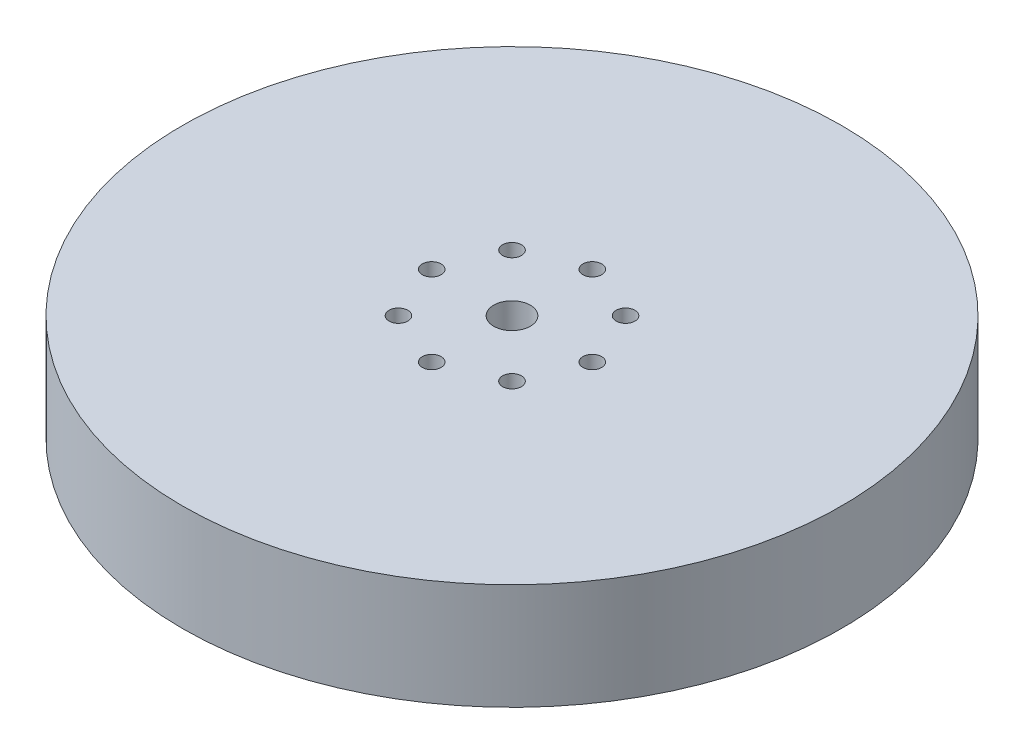
ISO-10303-21;
HEADER;
FILE_DESCRIPTION(('STEP AP214'),'2;1');
FILE_NAME('part.step','',(''),(''),'','','');
FILE_SCHEMA(('AUTOMOTIVE_DESIGN { 1 0 10303 214 1 1 1 1 }'));
ENDSEC;
DATA;
#1=APPLICATION_CONTEXT('core data for automotive mechanical design processes');
#2=APPLICATION_PROTOCOL_DEFINITION('international standard','automotive_design',2000,#1);
#3=PRODUCT_CONTEXT('',#1,'mechanical');
#4=PRODUCT('Part','Part','',(#3));
#5=PRODUCT_RELATED_PRODUCT_CATEGORY('part','',(#4));
#6=PRODUCT_DEFINITION_FORMATION('','',#4);
#7=PRODUCT_DEFINITION_CONTEXT('part definition',#1,'design');
#8=PRODUCT_DEFINITION('design','',#6,#7);
#9=PRODUCT_DEFINITION_SHAPE('','',#8);
#10=(LENGTH_UNIT() NAMED_UNIT(*) SI_UNIT(.MILLI.,.METRE.));
#11=(NAMED_UNIT(*) PLANE_ANGLE_UNIT() SI_UNIT($,.RADIAN.));
#12=(NAMED_UNIT(*) SI_UNIT($,.STERADIAN.) SOLID_ANGLE_UNIT());
#13=UNCERTAINTY_MEASURE_WITH_UNIT(LENGTH_MEASURE(1.E-05),#10,'distance_accuracy_value','');
#14=(GEOMETRIC_REPRESENTATION_CONTEXT(3) GLOBAL_UNCERTAINTY_ASSIGNED_CONTEXT((#13)) GLOBAL_UNIT_ASSIGNED_CONTEXT((#10,
#11,#12)) REPRESENTATION_CONTEXT('',''));
#15=CARTESIAN_POINT('',(0.,0.,0.));
#16=DIRECTION('',(0.,0.,1.));
#17=DIRECTION('',(1.,0.,0.));
#18=AXIS2_PLACEMENT_3D('',#15,#16,#17);
#19=CARTESIAN_POINT('',(0.,29.,0.));
#20=DIRECTION('',(0.,-1.,0.));
#21=DIRECTION('',(0.,0.,-1.));
#22=AXIS2_PLACEMENT_3D('',#19,#20,#21);
#23=CYLINDRICAL_SURFACE('',#22,90.);
#24=CARTESIAN_POINT('',(0.,29.,0.));
#25=DIRECTION('',(0.,1.,0.));
#26=DIRECTION('',(0.,0.,1.));
#27=AXIS2_PLACEMENT_3D('',#24,#25,#26);
#28=CIRCLE('',#27,90.);
#29=CARTESIAN_POINT('',(0.,29.,-90.));
#30=VERTEX_POINT('',#29);
#31=EDGE_CURVE('E10',#30,#30,#28,.T.);
#32=CARTESIAN_POINT('',(0.,0.,0.));
#33=DIRECTION('',(0.,1.,0.));
#34=DIRECTION('',(0.,0.,1.));
#35=AXIS2_PLACEMENT_3D('',#32,#33,#34);
#36=CIRCLE('',#35,90.);
#37=CARTESIAN_POINT('',(0.,0.,-90.));
#38=VERTEX_POINT('',#37);
#39=EDGE_CURVE('E37',#38,#38,#36,.T.);
#40=CARTESIAN_POINT('',(0.,29.,-90.));
#41=CARTESIAN_POINT('',(0.,28.6979166666667,-90.));
#42=CARTESIAN_POINT('',(0.,28.3958333333333,-90.));
#43=CARTESIAN_POINT('',(0.,27.7916666666667,-90.));
#44=CARTESIAN_POINT('',(0.,27.4895833333333,-90.));
#45=CARTESIAN_POINT('',(0.,26.8854166666667,-90.));
#46=CARTESIAN_POINT('',(0.,26.5833333333333,-90.));
#47=CARTESIAN_POINT('',(0.,25.9791666666667,-90.));
#48=CARTESIAN_POINT('',(0.,25.6770833333333,-90.));
#49=CARTESIAN_POINT('',(0.,25.0729166666667,-90.));
#50=CARTESIAN_POINT('',(0.,24.7708333333333,-90.));
#51=CARTESIAN_POINT('',(0.,24.1666666666667,-90.));
#52=CARTESIAN_POINT('',(0.,23.8645833333333,-90.));
#53=CARTESIAN_POINT('',(0.,23.2604166666667,-90.));
#54=CARTESIAN_POINT('',(0.,22.9583333333333,-90.));
#55=CARTESIAN_POINT('',(0.,22.3541666666667,-90.));
#56=CARTESIAN_POINT('',(0.,22.0520833333333,-90.));
#57=CARTESIAN_POINT('',(0.,21.4479166666667,-90.));
#58=CARTESIAN_POINT('',(0.,21.1458333333333,-90.));
#59=CARTESIAN_POINT('',(0.,20.5416666666667,-90.));
#60=CARTESIAN_POINT('',(0.,20.2395833333333,-90.));
#61=CARTESIAN_POINT('',(0.,19.6354166666667,-90.));
#62=CARTESIAN_POINT('',(0.,19.3333333333333,-90.));
#63=CARTESIAN_POINT('',(0.,18.7291666666667,-90.));
#64=CARTESIAN_POINT('',(0.,18.4270833333333,-90.));
#65=CARTESIAN_POINT('',(0.,17.8229166666667,-90.));
#66=CARTESIAN_POINT('',(0.,17.5208333333333,-90.));
#67=CARTESIAN_POINT('',(0.,16.9166666666667,-90.));
#68=CARTESIAN_POINT('',(0.,16.6145833333333,-90.));
#69=CARTESIAN_POINT('',(0.,16.0104166666667,-90.));
#70=CARTESIAN_POINT('',(0.,15.7083333333333,-90.));
#71=CARTESIAN_POINT('',(0.,15.1041666666667,-90.));
#72=CARTESIAN_POINT('',(0.,14.8020833333333,-90.));
#73=CARTESIAN_POINT('',(0.,14.1979166666667,-90.));
#74=CARTESIAN_POINT('',(0.,13.8958333333333,-90.));
#75=CARTESIAN_POINT('',(0.,13.2916666666667,-90.));
#76=CARTESIAN_POINT('',(0.,12.9895833333333,-90.));
#77=CARTESIAN_POINT('',(0.,12.3854166666667,-90.));
#78=CARTESIAN_POINT('',(0.,12.0833333333333,-90.));
#79=CARTESIAN_POINT('',(0.,11.4791666666667,-90.));
#80=CARTESIAN_POINT('',(0.,11.1770833333333,-90.));
#81=CARTESIAN_POINT('',(0.,10.5729166666667,-90.));
#82=CARTESIAN_POINT('',(0.,10.2708333333333,-90.));
#83=CARTESIAN_POINT('',(0.,9.66666666666667,-90.));
#84=CARTESIAN_POINT('',(0.,9.36458333333333,-90.));
#85=CARTESIAN_POINT('',(0.,8.76041666666667,-90.));
#86=CARTESIAN_POINT('',(0.,8.45833333333333,-90.));
#87=CARTESIAN_POINT('',(0.,7.85416666666667,-90.));
#88=CARTESIAN_POINT('',(0.,7.55208333333333,-90.));
#89=CARTESIAN_POINT('',(0.,6.94791666666667,-90.));
#90=CARTESIAN_POINT('',(0.,6.64583333333333,-90.));
#91=CARTESIAN_POINT('',(0.,6.04166666666667,-90.));
#92=CARTESIAN_POINT('',(0.,5.73958333333333,-90.));
#93=CARTESIAN_POINT('',(0.,5.13541666666667,-90.));
#94=CARTESIAN_POINT('',(0.,4.83333333333333,-90.));
#95=CARTESIAN_POINT('',(0.,4.22916666666667,-90.));
#96=CARTESIAN_POINT('',(0.,3.92708333333333,-90.));
#97=CARTESIAN_POINT('',(0.,3.32291666666667,-90.));
#98=CARTESIAN_POINT('',(0.,3.02083333333333,-90.));
#99=CARTESIAN_POINT('',(0.,2.41666666666667,-90.));
#100=CARTESIAN_POINT('',(0.,2.11458333333333,-90.));
#101=CARTESIAN_POINT('',(0.,1.51041666666667,-90.));
#102=CARTESIAN_POINT('',(0.,1.20833333333333,-90.));
#103=CARTESIAN_POINT('',(0.,0.604166666666667,-90.));
#104=CARTESIAN_POINT('',(0.,0.302083333333333,-90.));
#105=CARTESIAN_POINT('',(0.,0.,-90.));
#106=B_SPLINE_CURVE_WITH_KNOTS('',3,(#40,#41,#42,#43,#44,#45,#46,#47,#48,#49,#50,#51,#52,#53,
#54,#55,#56,#57,#58,#59,#60,#61,#62,#63,#64,#65,#66,#67,#68,#69,#70,#71,#72,#73,#74,#75,#76,#77,
#78,#79,#80,#81,#82,#83,#84,#85,#86,#87,#88,#89,#90,#91,#92,#93,#94,#95,#96,#97,#98,#99,#100,
#101,#102,#103,#104,#105),.UNSPECIFIED.,.F.,.F.,(4,2,2,2,2,2,2,2,2,2,2,2,2,2,2,2,2,2,2,2,2,2,2,
2,2,2,2,2,2,2,2,2,4),(0.,0.906250000000001,1.8125,2.71875,3.625,4.53125,5.4375,6.34375,7.25,
8.15625,9.0625,9.96875,10.875,11.78125,12.6875,13.59375,14.5,15.40625,16.3125,17.21875,18.125,
19.03125,19.9375,20.84375,21.75,22.65625,23.5625,24.46875,25.375,26.28125,27.1875,28.09375,29.),.UNSPECIFIED.);
#107=EDGE_CURVE('BSEAM40',#30,#38,#106,.T.);
#108=ORIENTED_EDGE('',*,*,#31,.F.);
#109=ORIENTED_EDGE('',*,*,#39,.T.);
#110=ORIENTED_EDGE('',*,*,#107,.T.);
#111=ORIENTED_EDGE('',*,*,#107,.F.);
#112=EDGE_LOOP('',(#108,#110,#109,#111));
#113=FACE_BOUND('',#112,.T.);
#114=ADVANCED_FACE('F40',(#113),#23,.T.);
#115=CARTESIAN_POINT('',(0.,29.,0.));
#116=DIRECTION('',(0.,1.,0.));
#117=DIRECTION('',(0.,0.,1.));
#118=AXIS2_PLACEMENT_3D('',#115,#116,#117);
#119=PLANE('',#118);
#120=CARTESIAN_POINT('',(0.,29.,21.9272905178165));
#121=DIRECTION('',(0.,1.,0.));
#122=DIRECTION('',(1.,0.,0.));
#123=AXIS2_PLACEMENT_3D('',#120,#121,#122);
#124=CIRCLE('',#123,2.57110412846013);
#125=CARTESIAN_POINT('',(2.57110412846021,29.,21.9272905178165));
#126=VERTEX_POINT('',#125);
#127=EDGE_CURVE('E88',#126,#126,#124,.T.);
#128=ORIENTED_EDGE('',*,*,#127,.F.);
#129=EDGE_LOOP('',(#128));
#130=FACE_BOUND('',#129,.T.);
#131=CARTESIAN_POINT('',(15.5049358181956,29.,15.5049358181954));
#132=DIRECTION('',(0.,1.,0.));
#133=DIRECTION('',(0.707106781186544,0.,-0.707106781186551));
#134=AXIS2_PLACEMENT_3D('',#131,#132,#133);
#135=CIRCLE('',#134,2.57110412846013);
#136=CARTESIAN_POINT('',(17.3229809825665,29.,13.6868906538246));
#137=VERTEX_POINT('',#136);
#138=EDGE_CURVE('E79',#137,#137,#135,.T.);
#139=ORIENTED_EDGE('',*,*,#138,.F.);
#140=EDGE_LOOP('',(#139));
#141=FACE_BOUND('',#140,.T.);
#142=CARTESIAN_POINT('',(21.9272905178165,29.,0.));
#143=DIRECTION('',(0.,1.,0.));
#144=DIRECTION('',(0.,0.,-1.));
#145=AXIS2_PLACEMENT_3D('',#142,#143,#144);
#146=CIRCLE('',#145,2.57110412846013);
#147=CARTESIAN_POINT('',(21.9272905178165,29.,-2.57110412846013));
#148=VERTEX_POINT('',#147);
#149=EDGE_CURVE('E74',#148,#148,#146,.T.);
#150=ORIENTED_EDGE('',*,*,#149,.F.);
#151=EDGE_LOOP('',(#150));
#152=FACE_BOUND('',#151,.T.);
#153=CARTESIAN_POINT('',(15.5049358181954,29.,-15.5049358181957));
#154=DIRECTION('',(0.,1.,0.));
#155=DIRECTION('',(-0.707106781186554,0.,-0.707106781186541));
#156=AXIS2_PLACEMENT_3D('',#153,#154,#155);
#157=CIRCLE('',#156,2.57110412846013);
#158=CARTESIAN_POINT('',(13.6868906538245,29.,-17.3229809825665));
#159=VERTEX_POINT('',#158);
#160=EDGE_CURVE('E70',#159,#159,#157,.T.);
#161=ORIENTED_EDGE('',*,*,#160,.F.);
#162=EDGE_LOOP('',(#161));
#163=FACE_BOUND('',#162,.T.);
#164=CARTESIAN_POINT('',(-2.29676176963045E-13,29.,-21.9272905178165));
#165=DIRECTION('',(0.,1.,0.));
#166=DIRECTION('',(-1.,0.,0.));
#167=AXIS2_PLACEMENT_3D('',#164,#165,#166);
#168=CIRCLE('',#167,2.57110412846013);
#169=CARTESIAN_POINT('',(-2.57110412846036,29.,-21.9272905178165));
#170=VERTEX_POINT('',#169);
#171=EDGE_CURVE('E100',#170,#170,#168,.T.);
#172=ORIENTED_EDGE('',*,*,#171,.F.);
#173=EDGE_LOOP('',(#172));
#174=FACE_BOUND('',#173,.T.);
#175=CARTESIAN_POINT('',(-15.5049358181957,29.,-15.5049358181953));
#176=DIRECTION('',(0.,1.,0.));
#177=DIRECTION('',(-0.707106781186539,0.,0.707106781186556));
#178=AXIS2_PLACEMENT_3D('',#175,#176,#177);
#179=CIRCLE('',#178,2.57110412846013);
#180=CARTESIAN_POINT('',(-17.3229809825666,29.,-13.6868906538244));
#181=VERTEX_POINT('',#180);
#182=EDGE_CURVE('E93',#181,#181,#179,.T.);
#183=ORIENTED_EDGE('',*,*,#182,.F.);
#184=EDGE_LOOP('',(#183));
#185=FACE_BOUND('',#184,.T.);
#186=CARTESIAN_POINT('',(-15.5049358181955,29.,15.5049358181956));
#187=DIRECTION('',(0.,1.,0.));
#188=DIRECTION('',(0.707106781186549,0.,0.707106781186546));
#189=AXIS2_PLACEMENT_3D('',#186,#187,#188);
#190=CIRCLE('',#189,2.57110412846013);
#191=CARTESIAN_POINT('',(-13.6868906538246,29.,17.3229809825664));
#192=VERTEX_POINT('',#191);
#193=EDGE_CURVE('E61',#192,#192,#190,.T.);
#194=ORIENTED_EDGE('',*,*,#193,.F.);
#195=EDGE_LOOP('',(#194));
#196=FACE_BOUND('',#195,.T.);
#197=CARTESIAN_POINT('',(-21.9272905178165,29.,0.));
#198=DIRECTION('',(0.,1.,0.));
#199=DIRECTION('',(0.,0.,1.));
#200=AXIS2_PLACEMENT_3D('',#197,#198,#199);
#201=CIRCLE('',#200,2.57110412846013);
#202=CARTESIAN_POINT('',(-21.9272905178165,29.,2.57110412846013));
#203=VERTEX_POINT('',#202);
#204=EDGE_CURVE('E54',#203,#203,#201,.T.);
#205=ORIENTED_EDGE('',*,*,#204,.F.);
#206=EDGE_LOOP('',(#205));
#207=FACE_BOUND('',#206,.T.);
#208=CARTESIAN_POINT('',(0.,29.,0.));
#209=DIRECTION('',(0.,1.,0.));
#210=DIRECTION('',(0.,0.,1.));
#211=AXIS2_PLACEMENT_3D('',#208,#209,#210);
#212=CIRCLE('',#211,5.);
#213=CARTESIAN_POINT('',(0.,29.,-5.));
#214=VERTEX_POINT('',#213);
#215=EDGE_CURVE('E50',#214,#214,#212,.T.);
#216=ORIENTED_EDGE('',*,*,#215,.F.);
#217=EDGE_LOOP('',(#216));
#218=FACE_BOUND('',#217,.T.);
#219=ORIENTED_EDGE('',*,*,#31,.T.);
#220=EDGE_LOOP('',(#219));
#221=FACE_BOUND('',#220,.T.);
#222=ADVANCED_FACE('F115',(#130,#141,#152,#163,#174,#185,#196,#207,#218,#221),#119,.T.);
#223=CARTESIAN_POINT('',(0.,0.,0.));
#224=DIRECTION('',(0.,1.,0.));
#225=DIRECTION('',(0.,0.,1.));
#226=AXIS2_PLACEMENT_3D('',#223,#224,#225);
#227=PLANE('',#226);
#228=CARTESIAN_POINT('',(0.,0.,0.));
#229=DIRECTION('',(0.,1.,0.));
#230=DIRECTION('',(0.,0.,1.));
#231=AXIS2_PLACEMENT_3D('',#228,#229,#230);
#232=CIRCLE('',#231,5.);
#233=CARTESIAN_POINT('',(0.,0.,-5.));
#234=VERTEX_POINT('',#233);
#235=EDGE_CURVE('E47',#234,#234,#232,.T.);
#236=ORIENTED_EDGE('',*,*,#235,.T.);
#237=EDGE_LOOP('',(#236));
#238=FACE_BOUND('',#237,.T.);
#239=ORIENTED_EDGE('',*,*,#39,.F.);
#240=EDGE_LOOP('',(#239));
#241=FACE_BOUND('',#240,.T.);
#242=ADVANCED_FACE('F113',(#238,#241),#227,.F.);
#243=CARTESIAN_POINT('',(0.,29.,0.));
#244=DIRECTION('',(0.,-1.,0.));
#245=DIRECTION('',(0.,0.,-1.));
#246=AXIS2_PLACEMENT_3D('',#243,#244,#245);
#247=CYLINDRICAL_SURFACE('',#246,5.);
#248=CARTESIAN_POINT('',(0.,29.,-5.));
#249=CARTESIAN_POINT('',(0.,28.6979166666667,-5.));
#250=CARTESIAN_POINT('',(0.,28.3958333333333,-5.));
#251=CARTESIAN_POINT('',(0.,27.7916666666667,-5.));
#252=CARTESIAN_POINT('',(0.,27.4895833333333,-5.));
#253=CARTESIAN_POINT('',(0.,26.8854166666667,-5.));
#254=CARTESIAN_POINT('',(0.,26.5833333333333,-5.));
#255=CARTESIAN_POINT('',(0.,25.9791666666667,-5.));
#256=CARTESIAN_POINT('',(0.,25.6770833333333,-5.));
#257=CARTESIAN_POINT('',(0.,25.0729166666667,-5.));
#258=CARTESIAN_POINT('',(0.,24.7708333333333,-5.));
#259=CARTESIAN_POINT('',(0.,24.1666666666667,-5.));
#260=CARTESIAN_POINT('',(0.,23.8645833333333,-5.));
#261=CARTESIAN_POINT('',(0.,23.2604166666667,-5.));
#262=CARTESIAN_POINT('',(0.,22.9583333333333,-5.));
#263=CARTESIAN_POINT('',(0.,22.3541666666667,-5.));
#264=CARTESIAN_POINT('',(0.,22.0520833333333,-5.));
#265=CARTESIAN_POINT('',(0.,21.4479166666667,-5.));
#266=CARTESIAN_POINT('',(0.,21.1458333333333,-5.));
#267=CARTESIAN_POINT('',(0.,20.5416666666667,-5.));
#268=CARTESIAN_POINT('',(0.,20.2395833333333,-5.));
#269=CARTESIAN_POINT('',(0.,19.6354166666667,-5.));
#270=CARTESIAN_POINT('',(0.,19.3333333333333,-5.));
#271=CARTESIAN_POINT('',(0.,18.7291666666667,-5.));
#272=CARTESIAN_POINT('',(0.,18.4270833333333,-5.));
#273=CARTESIAN_POINT('',(0.,17.8229166666667,-5.));
#274=CARTESIAN_POINT('',(0.,17.5208333333333,-5.));
#275=CARTESIAN_POINT('',(0.,16.9166666666667,-5.));
#276=CARTESIAN_POINT('',(0.,16.6145833333333,-5.));
#277=CARTESIAN_POINT('',(0.,16.0104166666667,-5.));
#278=CARTESIAN_POINT('',(0.,15.7083333333333,-5.));
#279=CARTESIAN_POINT('',(0.,15.1041666666667,-5.));
#280=CARTESIAN_POINT('',(0.,14.8020833333333,-5.));
#281=CARTESIAN_POINT('',(0.,14.1979166666667,-5.));
#282=CARTESIAN_POINT('',(0.,13.8958333333333,-5.));
#283=CARTESIAN_POINT('',(0.,13.2916666666667,-5.));
#284=CARTESIAN_POINT('',(0.,12.9895833333333,-5.));
#285=CARTESIAN_POINT('',(0.,12.3854166666667,-5.));
#286=CARTESIAN_POINT('',(0.,12.0833333333333,-5.));
#287=CARTESIAN_POINT('',(0.,11.4791666666667,-5.));
#288=CARTESIAN_POINT('',(0.,11.1770833333333,-5.));
#289=CARTESIAN_POINT('',(0.,10.5729166666667,-5.));
#290=CARTESIAN_POINT('',(0.,10.2708333333333,-5.));
#291=CARTESIAN_POINT('',(0.,9.66666666666667,-5.));
#292=CARTESIAN_POINT('',(0.,9.36458333333333,-5.));
#293=CARTESIAN_POINT('',(0.,8.76041666666667,-5.));
#294=CARTESIAN_POINT('',(0.,8.45833333333333,-5.));
#295=CARTESIAN_POINT('',(0.,7.85416666666667,-5.));
#296=CARTESIAN_POINT('',(0.,7.55208333333333,-5.));
#297=CARTESIAN_POINT('',(0.,6.94791666666667,-5.));
#298=CARTESIAN_POINT('',(0.,6.64583333333333,-5.));
#299=CARTESIAN_POINT('',(0.,6.04166666666667,-5.));
#300=CARTESIAN_POINT('',(0.,5.73958333333333,-5.));
#301=CARTESIAN_POINT('',(0.,5.13541666666667,-5.));
#302=CARTESIAN_POINT('',(0.,4.83333333333333,-5.));
#303=CARTESIAN_POINT('',(0.,4.22916666666667,-5.));
#304=CARTESIAN_POINT('',(0.,3.92708333333333,-5.));
#305=CARTESIAN_POINT('',(0.,3.32291666666667,-5.));
#306=CARTESIAN_POINT('',(0.,3.02083333333333,-5.));
#307=CARTESIAN_POINT('',(0.,2.41666666666667,-5.));
#308=CARTESIAN_POINT('',(0.,2.11458333333333,-5.));
#309=CARTESIAN_POINT('',(0.,1.51041666666667,-5.));
#310=CARTESIAN_POINT('',(0.,1.20833333333333,-5.));
#311=CARTESIAN_POINT('',(0.,0.604166666666667,-5.));
#312=CARTESIAN_POINT('',(0.,0.302083333333333,-5.));
#313=CARTESIAN_POINT('',(0.,0.,-5.));
#314=B_SPLINE_CURVE_WITH_KNOTS('',3,(#248,#249,#250,#251,#252,#253,#254,#255,#256,#257,#258,
#259,#260,#261,#262,#263,#264,#265,#266,#267,#268,#269,#270,#271,#272,#273,#274,#275,#276,#277,
#278,#279,#280,#281,#282,#283,#284,#285,#286,#287,#288,#289,#290,#291,#292,#293,#294,#295,#296,
#297,#298,#299,#300,#301,#302,#303,#304,#305,#306,#307,#308,#309,#310,#311,#312,#313),
.UNSPECIFIED.,.F.,.F.,(4,2,2,2,2,2,2,2,2,2,2,2,2,2,2,2,2,2,2,2,2,2,2,2,2,2,2,2,2,2,2,2,4),(0.,
0.906249999999997,1.8125,2.71875,3.625,4.53125,5.4375,6.34375,7.25,8.15625,9.0625,9.96875,
10.875,11.78125,12.6875,13.59375,14.5,15.40625,16.3125,17.21875,18.125,19.03125,19.9375,
20.84375,21.75,22.65625,23.5625,24.46875,25.375,26.28125,27.1875,28.09375,29.),.UNSPECIFIED.);
#315=EDGE_CURVE('BSEAM127',#214,#234,#314,.T.);
#316=ORIENTED_EDGE('',*,*,#215,.T.);
#317=ORIENTED_EDGE('',*,*,#235,.F.);
#318=ORIENTED_EDGE('',*,*,#315,.T.);
#319=ORIENTED_EDGE('',*,*,#315,.F.);
#320=EDGE_LOOP('',(#316,#318,#317,#319));
#321=FACE_BOUND('',#320,.T.);
#322=ADVANCED_FACE('F127',(#321),#247,.F.);
#323=CARTESIAN_POINT('',(-21.9272905178165,11.0740871285229,0.));
#324=DIRECTION('',(0.,1.,0.));
#325=DIRECTION('',(0.,0.,1.));
#326=AXIS2_PLACEMENT_3D('',#323,#324,#325);
#327=CYLINDRICAL_SURFACE('',#326,2.57110412846013);
#328=CARTESIAN_POINT('',(-21.9272905178165,11.0740871285229,0.));
#329=DIRECTION('',(0.,1.,0.));
#330=DIRECTION('',(0.,0.,1.));
#331=AXIS2_PLACEMENT_3D('',#328,#329,#330);
#332=CIRCLE('',#331,2.57110412846013);
#333=CARTESIAN_POINT('',(-21.9272905178165,11.0740871285229,2.57110412846013));
#334=VERTEX_POINT('',#333);
#335=EDGE_CURVE('E55',#334,#334,#332,.T.);
#336=ORIENTED_EDGE('',*,*,#335,.F.);
#337=EDGE_LOOP('',(#336));
#338=FACE_BOUND('',#337,.T.);
#339=ORIENTED_EDGE('',*,*,#204,.T.);
#340=EDGE_LOOP('',(#339));
#341=FACE_BOUND('',#340,.T.);
#342=ADVANCED_FACE('F129',(#338,#341),#327,.F.);
#343=CARTESIAN_POINT('',(-21.9272905178165,11.0740871285229,0.));
#344=DIRECTION('',(0.,1.,0.));
#345=DIRECTION('',(0.,0.,1.));
#346=AXIS2_PLACEMENT_3D('',#343,#344,#345);
#347=PLANE('',#346);
#348=ORIENTED_EDGE('',*,*,#335,.T.);
#349=EDGE_LOOP('',(#348));
#350=FACE_BOUND('',#349,.T.);
#351=ADVANCED_FACE('F157',(#350),#347,.T.);
#352=CARTESIAN_POINT('',(-15.5049358181955,11.0740871285229,15.5049358181956));
#353=DIRECTION('',(0.,1.,0.));
#354=DIRECTION('',(0.,0.,1.));
#355=AXIS2_PLACEMENT_3D('',#352,#353,#354);
#356=CYLINDRICAL_SURFACE('',#355,2.57110412846013);
#357=CARTESIAN_POINT('',(-15.5049358181955,11.0740871285229,15.5049358181956));
#358=DIRECTION('',(0.,1.,0.));
#359=DIRECTION('',(0.707106781186549,0.,0.707106781186546));
#360=AXIS2_PLACEMENT_3D('',#357,#358,#359);
#361=CIRCLE('',#360,2.57110412846013);
#362=CARTESIAN_POINT('',(-13.6868906538246,11.0740871285229,17.3229809825664));
#363=VERTEX_POINT('',#362);
#364=EDGE_CURVE('E59',#363,#363,#361,.T.);
#365=ORIENTED_EDGE('',*,*,#364,.F.);
#366=EDGE_LOOP('',(#365));
#367=FACE_BOUND('',#366,.T.);
#368=ORIENTED_EDGE('',*,*,#193,.T.);
#369=EDGE_LOOP('',(#368));
#370=FACE_BOUND('',#369,.T.);
#371=ADVANCED_FACE('F170',(#367,#370),#356,.F.);
#372=CARTESIAN_POINT('',(-15.5049358181955,11.0740871285229,15.5049358181956));
#373=DIRECTION('',(0.,1.,0.));
#374=DIRECTION('',(0.707106781186549,0.,0.707106781186546));
#375=AXIS2_PLACEMENT_3D('',#372,#373,#374);
#376=PLANE('',#375);
#377=ORIENTED_EDGE('',*,*,#364,.T.);
#378=EDGE_LOOP('',(#377));
#379=FACE_BOUND('',#378,.T.);
#380=ADVANCED_FACE('F182',(#379),#376,.T.);
#381=CARTESIAN_POINT('',(-15.5049358181957,11.0740871285229,-15.5049358181953));
#382=DIRECTION('',(0.,1.,0.));
#383=DIRECTION('',(0.,0.,1.));
#384=AXIS2_PLACEMENT_3D('',#381,#382,#383);
#385=CYLINDRICAL_SURFACE('',#384,2.57110412846013);
#386=CARTESIAN_POINT('',(-15.5049358181957,11.0740871285229,-15.5049358181953));
#387=DIRECTION('',(0.,1.,0.));
#388=DIRECTION('',(-0.707106781186539,0.,0.707106781186556));
#389=AXIS2_PLACEMENT_3D('',#386,#387,#388);
#390=CIRCLE('',#389,2.57110412846013);
#391=CARTESIAN_POINT('',(-17.3229809825666,11.0740871285229,-13.6868906538244));
#392=VERTEX_POINT('',#391);
#393=EDGE_CURVE('E94',#392,#392,#390,.T.);
#394=ORIENTED_EDGE('',*,*,#393,.F.);
#395=EDGE_LOOP('',(#394));
#396=FACE_BOUND('',#395,.T.);
#397=ORIENTED_EDGE('',*,*,#182,.T.);
#398=EDGE_LOOP('',(#397));
#399=FACE_BOUND('',#398,.T.);
#400=ADVANCED_FACE('F189',(#396,#399),#385,.F.);
#401=CARTESIAN_POINT('',(-15.5049358181957,11.0740871285229,-15.5049358181953));
#402=DIRECTION('',(0.,1.,0.));
#403=DIRECTION('',(-0.707106781186539,0.,0.707106781186556));
#404=AXIS2_PLACEMENT_3D('',#401,#402,#403);
#405=PLANE('',#404);
#406=ORIENTED_EDGE('',*,*,#393,.T.);
#407=EDGE_LOOP('',(#406));
#408=FACE_BOUND('',#407,.T.);
#409=ADVANCED_FACE('F107',(#408),#405,.T.);
#410=CARTESIAN_POINT('',(-2.29676176963045E-13,11.0740871285229,-21.9272905178165));
#411=DIRECTION('',(0.,1.,0.));
#412=DIRECTION('',(0.,0.,1.));
#413=AXIS2_PLACEMENT_3D('',#410,#411,#412);
#414=CYLINDRICAL_SURFACE('',#413,2.57110412846013);
#415=CARTESIAN_POINT('',(-2.29676176963045E-13,11.0740871285229,-21.9272905178165));
#416=DIRECTION('',(0.,1.,0.));
#417=DIRECTION('',(-1.,0.,0.));
#418=AXIS2_PLACEMENT_3D('',#415,#416,#417);
#419=CIRCLE('',#418,2.57110412846013);
#420=CARTESIAN_POINT('',(-2.57110412846036,11.0740871285229,-21.9272905178165));
#421=VERTEX_POINT('',#420);
#422=EDGE_CURVE('E72',#421,#421,#419,.T.);
#423=ORIENTED_EDGE('',*,*,#422,.F.);
#424=EDGE_LOOP('',(#423));
#425=FACE_BOUND('',#424,.T.);
#426=ORIENTED_EDGE('',*,*,#171,.T.);
#427=EDGE_LOOP('',(#426));
#428=FACE_BOUND('',#427,.T.);
#429=ADVANCED_FACE('F104',(#425,#428),#414,.F.);
#430=CARTESIAN_POINT('',(-2.29676176963045E-13,11.0740871285229,-21.9272905178165));
#431=DIRECTION('',(0.,1.,0.));
#432=DIRECTION('',(-1.,0.,0.));
#433=AXIS2_PLACEMENT_3D('',#430,#431,#432);
#434=PLANE('',#433);
#435=ORIENTED_EDGE('',*,*,#422,.T.);
#436=EDGE_LOOP('',(#435));
#437=FACE_BOUND('',#436,.T.);
#438=ADVANCED_FACE('F103',(#437),#434,.T.);
#439=CARTESIAN_POINT('',(15.5049358181954,11.0740871285229,-15.5049358181957));
#440=DIRECTION('',(0.,1.,0.));
#441=DIRECTION('',(0.,0.,1.));
#442=AXIS2_PLACEMENT_3D('',#439,#440,#441);
#443=CYLINDRICAL_SURFACE('',#442,2.57110412846013);
#444=CARTESIAN_POINT('',(15.5049358181954,11.0740871285229,-15.5049358181957));
#445=DIRECTION('',(0.,1.,0.));
#446=DIRECTION('',(-0.707106781186554,0.,-0.707106781186541));
#447=AXIS2_PLACEMENT_3D('',#444,#445,#446);
#448=CIRCLE('',#447,2.57110412846013);
#449=CARTESIAN_POINT('',(13.6868906538245,11.0740871285229,-17.3229809825665));
#450=VERTEX_POINT('',#449);
#451=EDGE_CURVE('E69',#450,#450,#448,.T.);
#452=ORIENTED_EDGE('',*,*,#451,.F.);
#453=EDGE_LOOP('',(#452));
#454=FACE_BOUND('',#453,.T.);
#455=ORIENTED_EDGE('',*,*,#160,.T.);
#456=EDGE_LOOP('',(#455));
#457=FACE_BOUND('',#456,.T.);
#458=ADVANCED_FACE('F219',(#454,#457),#443,.F.);
#459=CARTESIAN_POINT('',(15.5049358181954,11.0740871285229,-15.5049358181957));
#460=DIRECTION('',(0.,1.,0.));
#461=DIRECTION('',(-0.707106781186554,0.,-0.707106781186541));
#462=AXIS2_PLACEMENT_3D('',#459,#460,#461);
#463=PLANE('',#462);
#464=ORIENTED_EDGE('',*,*,#451,.T.);
#465=EDGE_LOOP('',(#464));
#466=FACE_BOUND('',#465,.T.);
#467=ADVANCED_FACE('F227',(#466),#463,.T.);
#468=CARTESIAN_POINT('',(21.9272905178165,11.0740871285229,0.));
#469=DIRECTION('',(0.,1.,0.));
#470=DIRECTION('',(0.,0.,1.));
#471=AXIS2_PLACEMENT_3D('',#468,#469,#470);
#472=CYLINDRICAL_SURFACE('',#471,2.57110412846013);
#473=CARTESIAN_POINT('',(21.9272905178165,11.0740871285229,0.));
#474=DIRECTION('',(0.,1.,0.));
#475=DIRECTION('',(0.,0.,-1.));
#476=AXIS2_PLACEMENT_3D('',#473,#474,#475);
#477=CIRCLE('',#476,2.57110412846013);
#478=CARTESIAN_POINT('',(21.9272905178165,11.0740871285229,-2.57110412846013));
#479=VERTEX_POINT('',#478);
#480=EDGE_CURVE('E80',#479,#479,#477,.T.);
#481=ORIENTED_EDGE('',*,*,#480,.F.);
#482=EDGE_LOOP('',(#481));
#483=FACE_BOUND('',#482,.T.);
#484=ORIENTED_EDGE('',*,*,#149,.T.);
#485=EDGE_LOOP('',(#484));
#486=FACE_BOUND('',#485,.T.);
#487=ADVANCED_FACE('F240',(#483,#486),#472,.F.);
#488=CARTESIAN_POINT('',(21.9272905178165,11.0740871285229,0.));
#489=DIRECTION('',(0.,1.,0.));
#490=DIRECTION('',(0.,0.,-1.));
#491=AXIS2_PLACEMENT_3D('',#488,#489,#490);
#492=PLANE('',#491);
#493=ORIENTED_EDGE('',*,*,#480,.T.);
#494=EDGE_LOOP('',(#493));
#495=FACE_BOUND('',#494,.T.);
#496=ADVANCED_FACE('F246',(#495),#492,.T.);
#497=CARTESIAN_POINT('',(15.5049358181956,11.0740871285229,15.5049358181954));
#498=DIRECTION('',(0.,1.,0.));
#499=DIRECTION('',(0.,0.,1.));
#500=AXIS2_PLACEMENT_3D('',#497,#498,#499);
#501=CYLINDRICAL_SURFACE('',#500,2.57110412846013);
#502=CARTESIAN_POINT('',(15.5049358181956,11.0740871285229,15.5049358181954));
#503=DIRECTION('',(0.,1.,0.));
#504=DIRECTION('',(0.707106781186544,0.,-0.707106781186551));
#505=AXIS2_PLACEMENT_3D('',#502,#503,#504);
#506=CIRCLE('',#505,2.57110412846013);
#507=CARTESIAN_POINT('',(17.3229809825665,11.0740871285229,13.6868906538246));
#508=VERTEX_POINT('',#507);
#509=EDGE_CURVE('E82',#508,#508,#506,.T.);
#510=ORIENTED_EDGE('',*,*,#509,.F.);
#511=EDGE_LOOP('',(#510));
#512=FACE_BOUND('',#511,.T.);
#513=ORIENTED_EDGE('',*,*,#138,.T.);
#514=EDGE_LOOP('',(#513));
#515=FACE_BOUND('',#514,.T.);
#516=ADVANCED_FACE('F254',(#512,#515),#501,.F.);
#517=CARTESIAN_POINT('',(15.5049358181956,11.0740871285229,15.5049358181954));
#518=DIRECTION('',(0.,1.,0.));
#519=DIRECTION('',(0.707106781186544,0.,-0.707106781186551));
#520=AXIS2_PLACEMENT_3D('',#517,#518,#519);
#521=PLANE('',#520);
#522=ORIENTED_EDGE('',*,*,#509,.T.);
#523=EDGE_LOOP('',(#522));
#524=FACE_BOUND('',#523,.T.);
#525=ADVANCED_FACE('F262',(#524),#521,.T.);
#526=CARTESIAN_POINT('',(0.,11.0740871285229,21.9272905178165));
#527=DIRECTION('',(0.,1.,0.));
#528=DIRECTION('',(0.,0.,1.));
#529=AXIS2_PLACEMENT_3D('',#526,#527,#528);
#530=CYLINDRICAL_SURFACE('',#529,2.57110412846013);
#531=CARTESIAN_POINT('',(0.,11.0740871285229,21.9272905178165));
#532=DIRECTION('',(0.,1.,0.));
#533=DIRECTION('',(1.,0.,0.));
#534=AXIS2_PLACEMENT_3D('',#531,#532,#533);
#535=CIRCLE('',#534,2.57110412846013);
#536=CARTESIAN_POINT('',(2.57110412846021,11.0740871285229,21.9272905178165));
#537=VERTEX_POINT('',#536);
#538=EDGE_CURVE('E63',#537,#537,#535,.T.);
#539=ORIENTED_EDGE('',*,*,#538,.F.);
#540=EDGE_LOOP('',(#539));
#541=FACE_BOUND('',#540,.T.);
#542=ORIENTED_EDGE('',*,*,#127,.T.);
#543=EDGE_LOOP('',(#542));
#544=FACE_BOUND('',#543,.T.);
#545=ADVANCED_FACE('F272',(#541,#544),#530,.F.);
#546=CARTESIAN_POINT('',(0.,11.0740871285229,21.9272905178165));
#547=DIRECTION('',(0.,1.,0.));
#548=DIRECTION('',(1.,0.,0.));
#549=AXIS2_PLACEMENT_3D('',#546,#547,#548);
#550=PLANE('',#549);
#551=ORIENTED_EDGE('',*,*,#538,.T.);
#552=EDGE_LOOP('',(#551));
#553=FACE_BOUND('',#552,.T.);
#554=ADVANCED_FACE('F285',(#553),#550,.T.);
#555=CLOSED_SHELL('',(#114,#222,#242,#322,#342,#351,#371,#380,#400,#409,#429,#438,#458,#467,
#487,#496,#516,#525,#545,#554));
#556=MANIFOLD_SOLID_BREP('B2',#555);
#557=ADVANCED_BREP_SHAPE_REPRESENTATION('',(#18,#556),#14);
#558=SHAPE_DEFINITION_REPRESENTATION(#9,#557);
ENDSEC;
END-ISO-10303-21;
